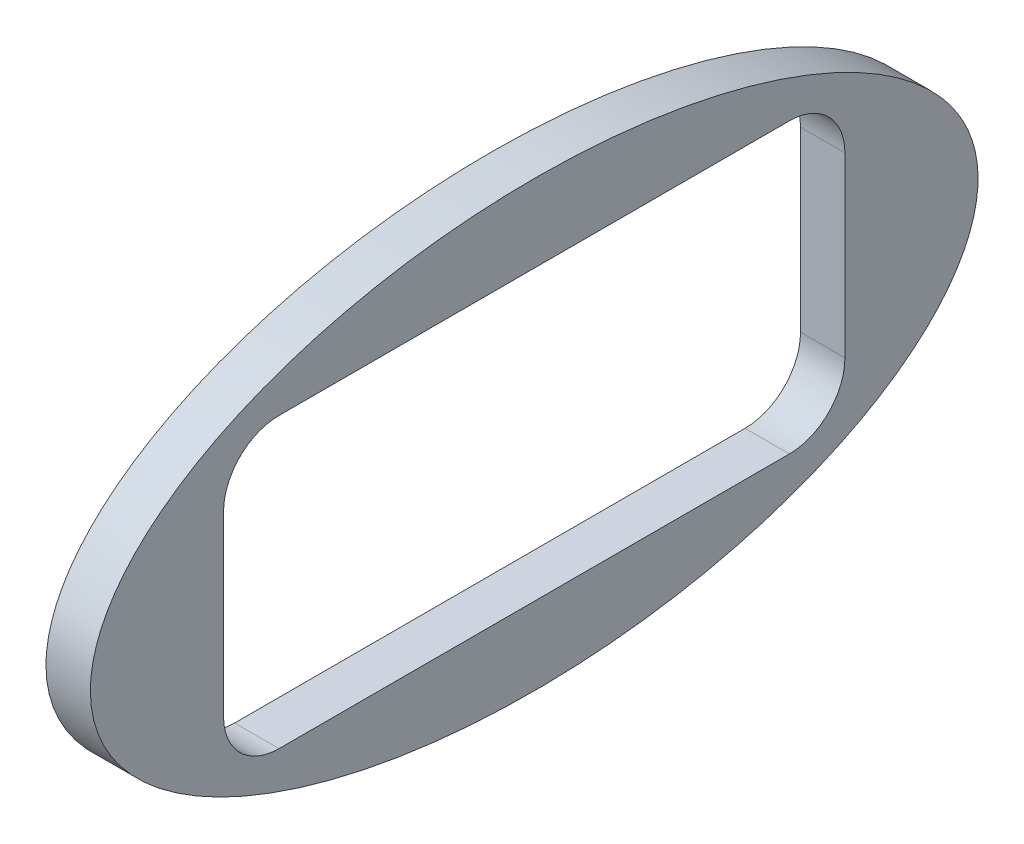
ISO-10303-21;
HEADER;
FILE_DESCRIPTION(('STEP AP214'),'2;1');
FILE_NAME('part.step','',(''),(''),'','','');
FILE_SCHEMA(('AUTOMOTIVE_DESIGN { 1 0 10303 214 1 1 1 1 }'));
ENDSEC;
DATA;
#1=APPLICATION_CONTEXT('core data for automotive mechanical design processes');
#2=APPLICATION_PROTOCOL_DEFINITION('international standard','automotive_design',2000,#1);
#3=PRODUCT_CONTEXT('',#1,'mechanical');
#4=PRODUCT('Part','Part','',(#3));
#5=PRODUCT_RELATED_PRODUCT_CATEGORY('part','',(#4));
#6=PRODUCT_DEFINITION_FORMATION('','',#4);
#7=PRODUCT_DEFINITION_CONTEXT('part definition',#1,'design');
#8=PRODUCT_DEFINITION('design','',#6,#7);
#9=PRODUCT_DEFINITION_SHAPE('','',#8);
#10=(LENGTH_UNIT() NAMED_UNIT(*) SI_UNIT(.MILLI.,.METRE.));
#11=(NAMED_UNIT(*) PLANE_ANGLE_UNIT() SI_UNIT($,.RADIAN.));
#12=(NAMED_UNIT(*) SI_UNIT($,.STERADIAN.) SOLID_ANGLE_UNIT());
#13=UNCERTAINTY_MEASURE_WITH_UNIT(LENGTH_MEASURE(1.E-05),#10,'distance_accuracy_value','');
#14=(GEOMETRIC_REPRESENTATION_CONTEXT(3) GLOBAL_UNCERTAINTY_ASSIGNED_CONTEXT((#13)) GLOBAL_UNIT_ASSIGNED_CONTEXT((#10,
#11,#12)) REPRESENTATION_CONTEXT('',''));
#15=CARTESIAN_POINT('',(0.,0.,0.));
#16=DIRECTION('',(0.,0.,1.));
#17=DIRECTION('',(1.,0.,0.));
#18=AXIS2_PLACEMENT_3D('',#15,#16,#17);
#19=CARTESIAN_POINT('',(1.,0.,0.));
#20=DIRECTION('',(1.,0.,0.));
#21=DIRECTION('',(0.,0.,-1.));
#22=AXIS2_PLACEMENT_3D('',#19,#20,#21);
#23=PLANE('',#22);
#24=CARTESIAN_POINT('',(1.,0.,0.));
#25=DIRECTION('',(1.,0.,0.));
#26=DIRECTION('',(0.,0.,1.));
#27=AXIS2_PLACEMENT_3D('',#24,#25,#26);
#28=ELLIPSE('',#27,10.,5.);
#29=CARTESIAN_POINT('',(1.,0.,10.));
#30=VERTEX_POINT('',#29);
#31=EDGE_CURVE('E11',#30,#30,#28,.T.);
#32=ORIENTED_EDGE('',*,*,#31,.T.);
#33=EDGE_LOOP('',(#32));
#34=FACE_BOUND('',#33,.T.);
#35=DIRECTION('',(0.,0.,-1.));
#36=VECTOR('',#35,1.);
#37=CARTESIAN_POINT('',(1.,-3.25,5.75));
#38=LINE('',#37,#36);
#39=CARTESIAN_POINT('',(1.,-3.25,5.75));
#40=VERTEX_POINT('',#39);
#41=CARTESIAN_POINT('',(1.,-3.25,-5.75));
#42=VERTEX_POINT('',#41);
#43=EDGE_CURVE('E111',#40,#42,#38,.T.);
#44=ORIENTED_EDGE('',*,*,#43,.F.);
#45=CARTESIAN_POINT('',(1.,-2.,5.75));
#46=DIRECTION('',(1.,0.,0.));
#47=DIRECTION('',(0.,0.,1.));
#48=AXIS2_PLACEMENT_3D('',#45,#46,#47);
#49=CIRCLE('',#48,1.25);
#50=CARTESIAN_POINT('',(1.,-2.,7.));
#51=VERTEX_POINT('',#50);
#52=EDGE_CURVE('E103',#51,#40,#49,.T.);
#53=ORIENTED_EDGE('',*,*,#52,.F.);
#54=DIRECTION('',(0.,-1.,0.));
#55=VECTOR('',#54,1.);
#56=CARTESIAN_POINT('',(1.,-2.,7.));
#57=LINE('',#56,#55);
#58=CARTESIAN_POINT('',(1.,2.,7.));
#59=VERTEX_POINT('',#58);
#60=EDGE_CURVE('E135',#59,#51,#57,.T.);
#61=ORIENTED_EDGE('',*,*,#60,.F.);
#62=CARTESIAN_POINT('',(1.,2.,5.75));
#63=DIRECTION('',(1.,0.,0.));
#64=DIRECTION('',(0.,0.,1.));
#65=AXIS2_PLACEMENT_3D('',#62,#63,#64);
#66=CIRCLE('',#65,1.25);
#67=CARTESIAN_POINT('',(1.,3.25,5.75));
#68=VERTEX_POINT('',#67);
#69=EDGE_CURVE('E133',#68,#59,#66,.T.);
#70=ORIENTED_EDGE('',*,*,#69,.F.);
#71=DIRECTION('',(0.,0.,1.));
#72=VECTOR('',#71,1.);
#73=CARTESIAN_POINT('',(1.,3.25,5.75));
#74=LINE('',#73,#72);
#75=CARTESIAN_POINT('',(1.,3.25,-5.75));
#76=VERTEX_POINT('',#75);
#77=EDGE_CURVE('E131',#76,#68,#74,.T.);
#78=ORIENTED_EDGE('',*,*,#77,.F.);
#79=CARTESIAN_POINT('',(1.,2.,-5.75));
#80=DIRECTION('',(1.,0.,0.));
#81=DIRECTION('',(0.,0.,1.));
#82=AXIS2_PLACEMENT_3D('',#79,#80,#81);
#83=CIRCLE('',#82,1.25);
#84=CARTESIAN_POINT('',(1.,2.,-7.));
#85=VERTEX_POINT('',#84);
#86=EDGE_CURVE('E129',#85,#76,#83,.T.);
#87=ORIENTED_EDGE('',*,*,#86,.F.);
#88=DIRECTION('',(0.,1.,0.));
#89=VECTOR('',#88,1.);
#90=CARTESIAN_POINT('',(1.,-2.,-7.));
#91=LINE('',#90,#89);
#92=CARTESIAN_POINT('',(1.,-2.,-7.));
#93=VERTEX_POINT('',#92);
#94=EDGE_CURVE('E125',#93,#85,#91,.T.);
#95=ORIENTED_EDGE('',*,*,#94,.F.);
#96=CARTESIAN_POINT('',(1.,-2.,-5.75));
#97=DIRECTION('',(1.,0.,0.));
#98=DIRECTION('',(0.,0.,-1.));
#99=AXIS2_PLACEMENT_3D('',#96,#97,#98);
#100=CIRCLE('',#99,1.25);
#101=EDGE_CURVE('E123',#42,#93,#100,.T.);
#102=ORIENTED_EDGE('',*,*,#101,.F.);
#103=EDGE_LOOP('',(#44,#53,#61,#70,#78,#87,#95,#102));
#104=FACE_BOUND('',#103,.T.);
#105=ADVANCED_FACE('F38',(#34,#104),#23,.T.);
#106=CARTESIAN_POINT('',(0.,0.,0.));
#107=DIRECTION('',(1.,0.,0.));
#108=DIRECTION('',(0.,0.,-1.));
#109=AXIS2_PLACEMENT_3D('',#106,#107,#108);
#110=PLANE('',#109);
#111=CARTESIAN_POINT('',(0.,0.,0.));
#112=DIRECTION('',(1.,0.,0.));
#113=DIRECTION('',(0.,0.,1.));
#114=AXIS2_PLACEMENT_3D('',#111,#112,#113);
#115=ELLIPSE('',#114,10.,5.);
#116=CARTESIAN_POINT('',(0.,0.,10.));
#117=VERTEX_POINT('',#116);
#118=EDGE_CURVE('E43',#117,#117,#115,.T.);
#119=ORIENTED_EDGE('',*,*,#118,.F.);
#120=EDGE_LOOP('',(#119));
#121=FACE_BOUND('',#120,.T.);
#122=CARTESIAN_POINT('',(0.,-2.,5.75));
#123=DIRECTION('',(1.,0.,0.));
#124=DIRECTION('',(0.,0.,1.));
#125=AXIS2_PLACEMENT_3D('',#122,#123,#124);
#126=CIRCLE('',#125,1.25);
#127=CARTESIAN_POINT('',(0.,-2.,7.));
#128=VERTEX_POINT('',#127);
#129=CARTESIAN_POINT('',(0.,-3.25,5.75));
#130=VERTEX_POINT('',#129);
#131=EDGE_CURVE('E61',#128,#130,#126,.T.);
#132=ORIENTED_EDGE('',*,*,#131,.T.);
#133=DIRECTION('',(0.,0.,-1.));
#134=VECTOR('',#133,1.);
#135=CARTESIAN_POINT('',(0.,-3.25,5.75));
#136=LINE('',#135,#134);
#137=CARTESIAN_POINT('',(0.,-3.25,-5.75));
#138=VERTEX_POINT('',#137);
#139=EDGE_CURVE('E118',#130,#138,#136,.T.);
#140=ORIENTED_EDGE('',*,*,#139,.T.);
#141=CARTESIAN_POINT('',(0.,-2.,-5.75));
#142=DIRECTION('',(1.,0.,0.));
#143=DIRECTION('',(0.,0.,-1.));
#144=AXIS2_PLACEMENT_3D('',#141,#142,#143);
#145=CIRCLE('',#144,1.25);
#146=CARTESIAN_POINT('',(0.,-2.,-7.));
#147=VERTEX_POINT('',#146);
#148=EDGE_CURVE('E139',#138,#147,#145,.T.);
#149=ORIENTED_EDGE('',*,*,#148,.T.);
#150=DIRECTION('',(0.,1.,0.));
#151=VECTOR('',#150,1.);
#152=CARTESIAN_POINT('',(0.,-2.,-7.));
#153=LINE('',#152,#151);
#154=CARTESIAN_POINT('',(0.,2.,-7.));
#155=VERTEX_POINT('',#154);
#156=EDGE_CURVE('E142',#147,#155,#153,.T.);
#157=ORIENTED_EDGE('',*,*,#156,.T.);
#158=CARTESIAN_POINT('',(0.,2.,-5.75));
#159=DIRECTION('',(1.,0.,0.));
#160=DIRECTION('',(0.,0.,1.));
#161=AXIS2_PLACEMENT_3D('',#158,#159,#160);
#162=CIRCLE('',#161,1.25);
#163=CARTESIAN_POINT('',(0.,3.25,-5.75));
#164=VERTEX_POINT('',#163);
#165=EDGE_CURVE('E145',#155,#164,#162,.T.);
#166=ORIENTED_EDGE('',*,*,#165,.T.);
#167=DIRECTION('',(0.,0.,1.));
#168=VECTOR('',#167,1.);
#169=CARTESIAN_POINT('',(0.,3.25,5.75));
#170=LINE('',#169,#168);
#171=CARTESIAN_POINT('',(0.,3.25,5.75));
#172=VERTEX_POINT('',#171);
#173=EDGE_CURVE('E148',#164,#172,#170,.T.);
#174=ORIENTED_EDGE('',*,*,#173,.T.);
#175=CARTESIAN_POINT('',(0.,2.,5.75));
#176=DIRECTION('',(1.,0.,0.));
#177=DIRECTION('',(0.,0.,1.));
#178=AXIS2_PLACEMENT_3D('',#175,#176,#177);
#179=CIRCLE('',#178,1.25);
#180=CARTESIAN_POINT('',(0.,2.,7.));
#181=VERTEX_POINT('',#180);
#182=EDGE_CURVE('E151',#172,#181,#179,.T.);
#183=ORIENTED_EDGE('',*,*,#182,.T.);
#184=DIRECTION('',(0.,-1.,0.));
#185=VECTOR('',#184,1.);
#186=CARTESIAN_POINT('',(0.,-2.,7.));
#187=LINE('',#186,#185);
#188=EDGE_CURVE('E112',#181,#128,#187,.T.);
#189=ORIENTED_EDGE('',*,*,#188,.T.);
#190=EDGE_LOOP('',(#132,#140,#149,#157,#166,#174,#183,#189));
#191=FACE_BOUND('',#190,.T.);
#192=ADVANCED_FACE('F173',(#121,#191),#110,.F.);
#193=DIRECTION('',(-1.,0.,0.));
#194=VECTOR('',#193,1.);
#195=SURFACE_OF_LINEAR_EXTRUSION('',#28,#194);
#196=ORIENTED_EDGE('',*,*,#31,.F.);
#197=EDGE_LOOP('',(#196));
#198=FACE_BOUND('',#197,.T.);
#199=ORIENTED_EDGE('',*,*,#118,.T.);
#200=EDGE_LOOP('',(#199));
#201=FACE_BOUND('',#200,.T.);
#202=ADVANCED_FACE('F40',(#198,#201),#195,.F.);
#203=CARTESIAN_POINT('',(1.,-2.,5.75));
#204=DIRECTION('',(-1.,0.,0.));
#205=DIRECTION('',(0.,0.,1.));
#206=AXIS2_PLACEMENT_3D('',#203,#204,#205);
#207=CYLINDRICAL_SURFACE('',#206,1.25);
#208=ORIENTED_EDGE('',*,*,#131,.F.);
#209=DIRECTION('',(-1.,0.,0.));
#210=VECTOR('',#209,1.);
#211=CARTESIAN_POINT('',(1.,-2.,7.));
#212=LINE('',#211,#210);
#213=EDGE_CURVE('E107',#51,#128,#212,.T.);
#214=ORIENTED_EDGE('',*,*,#213,.F.);
#215=ORIENTED_EDGE('',*,*,#52,.T.);
#216=DIRECTION('',(-1.,0.,0.));
#217=VECTOR('',#216,1.);
#218=CARTESIAN_POINT('',(1.,-3.25,5.75));
#219=LINE('',#218,#217);
#220=EDGE_CURVE('E106',#40,#130,#219,.T.);
#221=ORIENTED_EDGE('',*,*,#220,.T.);
#222=EDGE_LOOP('',(#208,#214,#215,#221));
#223=FACE_BOUND('',#222,.T.);
#224=ADVANCED_FACE('F105',(#223),#207,.F.);
#225=CARTESIAN_POINT('',(1.,-3.25,5.75));
#226=DIRECTION('',(0.,1.,0.));
#227=DIRECTION('',(0.,0.,1.));
#228=AXIS2_PLACEMENT_3D('',#225,#226,#227);
#229=PLANE('',#228);
#230=ORIENTED_EDGE('',*,*,#139,.F.);
#231=ORIENTED_EDGE('',*,*,#220,.F.);
#232=ORIENTED_EDGE('',*,*,#43,.T.);
#233=DIRECTION('',(-1.,0.,0.));
#234=VECTOR('',#233,1.);
#235=CARTESIAN_POINT('',(1.,-3.25,-5.75));
#236=LINE('',#235,#234);
#237=EDGE_CURVE('E119',#42,#138,#236,.T.);
#238=ORIENTED_EDGE('',*,*,#237,.T.);
#239=EDGE_LOOP('',(#230,#231,#232,#238));
#240=FACE_BOUND('',#239,.T.);
#241=ADVANCED_FACE('F115',(#240),#229,.T.);
#242=CARTESIAN_POINT('',(1.,-2.,-5.75));
#243=DIRECTION('',(-1.,0.,0.));
#244=DIRECTION('',(0.,0.,1.));
#245=AXIS2_PLACEMENT_3D('',#242,#243,#244);
#246=CYLINDRICAL_SURFACE('',#245,1.25);
#247=ORIENTED_EDGE('',*,*,#148,.F.);
#248=ORIENTED_EDGE('',*,*,#237,.F.);
#249=ORIENTED_EDGE('',*,*,#101,.T.);
#250=DIRECTION('',(-1.,0.,0.));
#251=VECTOR('',#250,1.);
#252=CARTESIAN_POINT('',(1.,-2.,-7.));
#253=LINE('',#252,#251);
#254=EDGE_CURVE('E164',#93,#147,#253,.T.);
#255=ORIENTED_EDGE('',*,*,#254,.T.);
#256=EDGE_LOOP('',(#247,#248,#249,#255));
#257=FACE_BOUND('',#256,.T.);
#258=ADVANCED_FACE('F169',(#257),#246,.F.);
#259=CARTESIAN_POINT('',(1.,-2.,-7.));
#260=DIRECTION('',(0.,0.,1.));
#261=DIRECTION('',(1.,0.,0.));
#262=AXIS2_PLACEMENT_3D('',#259,#260,#261);
#263=PLANE('',#262);
#264=ORIENTED_EDGE('',*,*,#156,.F.);
#265=ORIENTED_EDGE('',*,*,#254,.F.);
#266=ORIENTED_EDGE('',*,*,#94,.T.);
#267=DIRECTION('',(-1.,0.,0.));
#268=VECTOR('',#267,1.);
#269=CARTESIAN_POINT('',(1.,2.,-7.));
#270=LINE('',#269,#268);
#271=EDGE_CURVE('E162',#85,#155,#270,.T.);
#272=ORIENTED_EDGE('',*,*,#271,.T.);
#273=EDGE_LOOP('',(#264,#265,#266,#272));
#274=FACE_BOUND('',#273,.T.);
#275=ADVANCED_FACE('F191',(#274),#263,.T.);
#276=CARTESIAN_POINT('',(1.,2.,-5.75));
#277=DIRECTION('',(-1.,0.,0.));
#278=DIRECTION('',(0.,0.,1.));
#279=AXIS2_PLACEMENT_3D('',#276,#277,#278);
#280=CYLINDRICAL_SURFACE('',#279,1.25);
#281=ORIENTED_EDGE('',*,*,#165,.F.);
#282=ORIENTED_EDGE('',*,*,#271,.F.);
#283=ORIENTED_EDGE('',*,*,#86,.T.);
#284=DIRECTION('',(-1.,0.,0.));
#285=VECTOR('',#284,1.);
#286=CARTESIAN_POINT('',(1.,3.25,-5.75));
#287=LINE('',#286,#285);
#288=EDGE_CURVE('E160',#76,#164,#287,.T.);
#289=ORIENTED_EDGE('',*,*,#288,.T.);
#290=EDGE_LOOP('',(#281,#282,#283,#289));
#291=FACE_BOUND('',#290,.T.);
#292=ADVANCED_FACE('F188',(#291),#280,.F.);
#293=CARTESIAN_POINT('',(1.,3.25,5.75));
#294=DIRECTION('',(0.,-1.,0.));
#295=DIRECTION('',(0.,0.,-1.));
#296=AXIS2_PLACEMENT_3D('',#293,#294,#295);
#297=PLANE('',#296);
#298=ORIENTED_EDGE('',*,*,#173,.F.);
#299=ORIENTED_EDGE('',*,*,#288,.F.);
#300=ORIENTED_EDGE('',*,*,#77,.T.);
#301=DIRECTION('',(-1.,0.,0.));
#302=VECTOR('',#301,1.);
#303=CARTESIAN_POINT('',(1.,3.25,5.75));
#304=LINE('',#303,#302);
#305=EDGE_CURVE('E158',#68,#172,#304,.T.);
#306=ORIENTED_EDGE('',*,*,#305,.T.);
#307=EDGE_LOOP('',(#298,#299,#300,#306));
#308=FACE_BOUND('',#307,.T.);
#309=ADVANCED_FACE('F184',(#308),#297,.T.);
#310=CARTESIAN_POINT('',(1.,2.,5.75));
#311=DIRECTION('',(-1.,0.,0.));
#312=DIRECTION('',(0.,0.,1.));
#313=AXIS2_PLACEMENT_3D('',#310,#311,#312);
#314=CYLINDRICAL_SURFACE('',#313,1.25);
#315=ORIENTED_EDGE('',*,*,#182,.F.);
#316=ORIENTED_EDGE('',*,*,#305,.F.);
#317=ORIENTED_EDGE('',*,*,#69,.T.);
#318=DIRECTION('',(-1.,0.,0.));
#319=VECTOR('',#318,1.);
#320=CARTESIAN_POINT('',(1.,2.,7.));
#321=LINE('',#320,#319);
#322=EDGE_CURVE('E53',#59,#181,#321,.T.);
#323=ORIENTED_EDGE('',*,*,#322,.T.);
#324=EDGE_LOOP('',(#315,#316,#317,#323));
#325=FACE_BOUND('',#324,.T.);
#326=ADVANCED_FACE('F181',(#325),#314,.F.);
#327=CARTESIAN_POINT('',(1.,-2.,7.));
#328=DIRECTION('',(0.,0.,-1.));
#329=DIRECTION('',(-1.,0.,0.));
#330=AXIS2_PLACEMENT_3D('',#327,#328,#329);
#331=PLANE('',#330);
#332=ORIENTED_EDGE('',*,*,#188,.F.);
#333=ORIENTED_EDGE('',*,*,#322,.F.);
#334=ORIENTED_EDGE('',*,*,#60,.T.);
#335=ORIENTED_EDGE('',*,*,#213,.T.);
#336=EDGE_LOOP('',(#332,#333,#334,#335));
#337=FACE_BOUND('',#336,.T.);
#338=ADVANCED_FACE('F175',(#337),#331,.T.);
#339=CLOSED_SHELL('',(#105,#192,#202,#224,#241,#258,#275,#292,#309,#326,#338));
#340=MANIFOLD_SOLID_BREP('B2',#339);
#341=ADVANCED_BREP_SHAPE_REPRESENTATION('',(#18,#340),#14);
#342=SHAPE_DEFINITION_REPRESENTATION(#9,#341);
ENDSEC;
END-ISO-10303-21;
